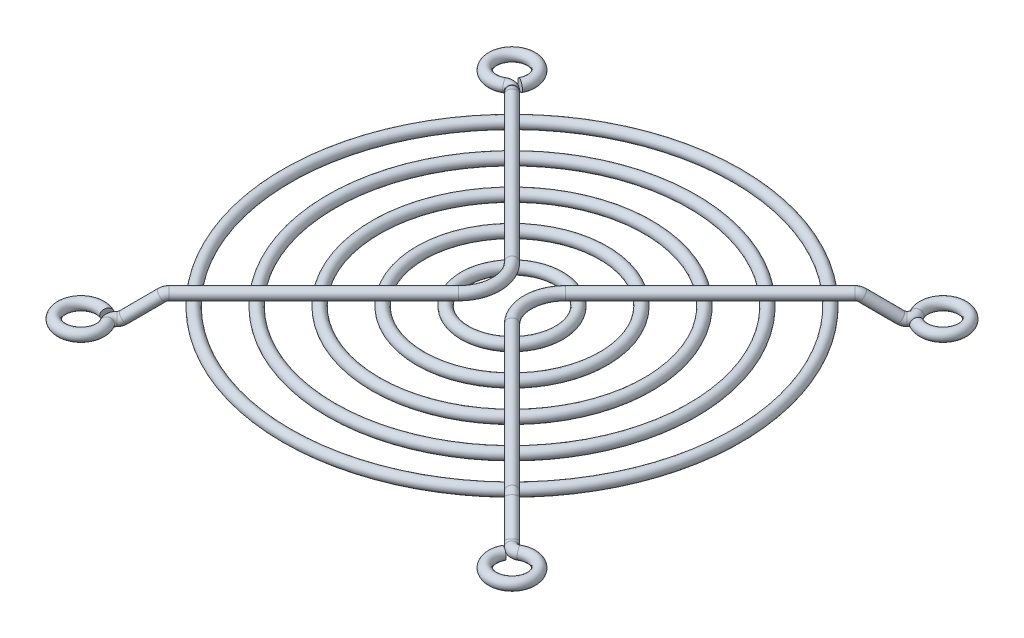
ISO-10303-21;
HEADER;
FILE_DESCRIPTION(('STEP AP214'),'2;1');
FILE_NAME('part.step','',(''),(''),'','','');
FILE_SCHEMA(('AUTOMOTIVE_DESIGN { 1 0 10303 214 1 1 1 1 }'));
ENDSEC;
DATA;
#1=APPLICATION_CONTEXT('core data for automotive mechanical design processes');
#2=APPLICATION_PROTOCOL_DEFINITION('international standard','automotive_design',2000,#1);
#3=PRODUCT_CONTEXT('',#1,'mechanical');
#4=PRODUCT('Part','Part','',(#3));
#5=PRODUCT_RELATED_PRODUCT_CATEGORY('part','',(#4));
#6=PRODUCT_DEFINITION_FORMATION('','',#4);
#7=PRODUCT_DEFINITION_CONTEXT('part definition',#1,'design');
#8=PRODUCT_DEFINITION('design','',#6,#7);
#9=PRODUCT_DEFINITION_SHAPE('','',#8);
#10=(LENGTH_UNIT() NAMED_UNIT(*) SI_UNIT(.MILLI.,.METRE.));
#11=(NAMED_UNIT(*) PLANE_ANGLE_UNIT() SI_UNIT($,.RADIAN.));
#12=(NAMED_UNIT(*) SI_UNIT($,.STERADIAN.) SOLID_ANGLE_UNIT());
#13=UNCERTAINTY_MEASURE_WITH_UNIT(LENGTH_MEASURE(1.E-05),#10,'distance_accuracy_value','');
#14=(GEOMETRIC_REPRESENTATION_CONTEXT(3) GLOBAL_UNCERTAINTY_ASSIGNED_CONTEXT((#13)) GLOBAL_UNIT_ASSIGNED_CONTEXT((#10,
#11,#12)) REPRESENTATION_CONTEXT('',''));
#15=CARTESIAN_POINT('',(0.,0.,0.));
#16=DIRECTION('',(0.,0.,1.));
#17=DIRECTION('',(1.,0.,0.));
#18=AXIS2_PLACEMENT_3D('',#15,#16,#17);
#19=CARTESIAN_POINT('',(4.43847763108504,4.6,4.43847763108509));
#20=DIRECTION('',(0.707106781186544,0.,0.707106781186552));
#21=DIRECTION('',(0.707106781186552,0.,-0.707106781186544));
#22=AXIS2_PLACEMENT_3D('',#19,#20,#21);
#23=CYLINDRICAL_SURFACE('',#22,0.9);
#24=CARTESIAN_POINT('',(4.43847763108504,4.6,4.43847763108509));
#25=DIRECTION('',(-0.707106781186544,0.,-0.707106781186551));
#26=DIRECTION('',(-0.707106781186551,0.,0.707106781186544));
#27=AXIS2_PLACEMENT_3D('',#24,#25,#26);
#28=CIRCLE('',#27,0.9);
#29=CARTESIAN_POINT('',(3.80208152801715,4.6,5.07487373415297));
#30=VERTEX_POINT('',#29);
#31=EDGE_CURVE('E11',#30,#30,#28,.T.);
#32=ORIENTED_EDGE('',*,*,#31,.F.);
#33=EDGE_LOOP('',(#32));
#34=FACE_BOUND('',#33,.T.);
#35=CARTESIAN_POINT('',(28.4610479427584,4.6,28.4610479427587));
#36=DIRECTION('',(0.707106781186543,0.,0.707106781186552));
#37=DIRECTION('',(0.707106781186552,0.,-0.707106781186543));
#38=AXIS2_PLACEMENT_3D('',#35,#36,#37);
#39=CIRCLE('',#38,0.9);
#40=CARTESIAN_POINT('',(28.4610479427584,5.5,28.4610479427587));
#41=VERTEX_POINT('',#40);
#42=EDGE_CURVE('E60',#41,#41,#39,.T.);
#43=ORIENTED_EDGE('',*,*,#42,.F.);
#44=EDGE_LOOP('',(#43));
#45=FACE_BOUND('',#44,.T.);
#46=ADVANCED_FACE('F41',(#34,#45),#23,.T.);
#47=CARTESIAN_POINT('',(32.7801515190163,2.31228886345619,32.7801515190167));
#48=DIRECTION('',(-0.707106781186546,0.,0.707106781186549));
#49=DIRECTION('',(0.707106781186549,0.,0.707106781186546));
#50=AXIS2_PLACEMENT_3D('',#47,#48,#49);
#51=TOROIDAL_SURFACE('',#50,1.41228886345618,0.9);
#52=CARTESIAN_POINT('',(32.2016837710717,1.161067788676,32.201683771072));
#53=DIRECTION('',(0.576394992331678,-0.579256096756797,0.576394992331687));
#54=DIRECTION('',(0.707106781186551,0.,-0.707106781186544));
#55=AXIS2_PLACEMENT_3D('',#52,#53,#54);
#56=CIRCLE('',#55,0.9);
#57=CARTESIAN_POINT('',(31.8330474484173,0.427436734780553,31.8330474484177));
#58=VERTEX_POINT('',#57);
#59=EDGE_CURVE('E51',#58,#58,#56,.T.);
#60=CARTESIAN_POINT('',(32.7801515190163,0.900000000000005,32.7801515190166));
#61=DIRECTION('',(0.707106781186543,0.,0.707106781186552));
#62=DIRECTION('',(0.707106781186552,0.,-0.707106781186543));
#63=AXIS2_PLACEMENT_3D('',#60,#61,#62);
#64=CIRCLE('',#63,0.9);
#65=CARTESIAN_POINT('',(32.7801515190163,0.,32.7801515190166));
#66=VERTEX_POINT('',#65);
#67=EDGE_CURVE('E47',#66,#66,#64,.T.);
#68=CARTESIAN_POINT('',(32.7801515190163,2.31228886345619,32.7801515190167));
#69=DIRECTION('',(-0.707106781186546,0.,0.707106781186549));
#70=DIRECTION('',(0.707106781186549,0.,0.707106781186546));
#71=AXIS2_PLACEMENT_3D('',#68,#69,#70);
#72=CIRCLE('',#71,2.31228886345618);
#73=EDGE_CURVE('',#58,#66,#72,.T.);
#74=ORIENTED_EDGE('',*,*,#59,.T.);
#75=ORIENTED_EDGE('',*,*,#67,.F.);
#76=ORIENTED_EDGE('',*,*,#73,.T.);
#77=ORIENTED_EDGE('',*,*,#73,.F.);
#78=EDGE_LOOP('',(#74,#76,#75,#77));
#79=FACE_BOUND('',#78,.T.);
#80=ADVANCED_FACE('F118',(#79),#51,.T.);
#81=CARTESIAN_POINT('',(29.039515690703,4.33893221132402,29.0395156907033));
#82=DIRECTION('',(0.576394992331679,-0.579256096756805,0.576394992331677));
#83=DIRECTION('',(-0.708855229154367,-0.705353999138383,0.));
#84=AXIS2_PLACEMENT_3D('',#81,#82,#83);
#85=CYLINDRICAL_SURFACE('',#84,0.9);
#86=CARTESIAN_POINT('',(29.039515690703,4.33893221132402,29.0395156907033));
#87=DIRECTION('',(0.576394992331678,-0.579256096756797,0.576394992331687));
#88=DIRECTION('',(0.707106781186551,0.,-0.707106781186544));
#89=AXIS2_PLACEMENT_3D('',#86,#87,#88);
#90=CIRCLE('',#89,0.9);
#91=CARTESIAN_POINT('',(29.4081520133573,5.07256326521949,29.4081520133577));
#92=VERTEX_POINT('',#91);
#93=EDGE_CURVE('E55',#92,#92,#90,.T.);
#94=ORIENTED_EDGE('',*,*,#93,.T.);
#95=EDGE_LOOP('',(#94));
#96=FACE_BOUND('',#95,.T.);
#97=ORIENTED_EDGE('',*,*,#59,.F.);
#98=EDGE_LOOP('',(#97));
#99=FACE_BOUND('',#98,.T.);
#100=ADVANCED_FACE('F123',(#96,#99),#85,.T.);
#101=CARTESIAN_POINT('',(28.4610479427584,3.18771113654381,28.4610479427587));
#102=DIRECTION('',(-0.707106781186546,0.,0.707106781186549));
#103=DIRECTION('',(0.707106781186549,0.,0.707106781186546));
#104=AXIS2_PLACEMENT_3D('',#101,#102,#103);
#105=TOROIDAL_SURFACE('',#104,1.41228886345619,0.9);
#106=CARTESIAN_POINT('',(28.4610479427584,3.18771113654381,28.4610479427587));
#107=DIRECTION('',(-0.707106781186546,0.,0.707106781186549));
#108=DIRECTION('',(0.707106781186549,0.,0.707106781186546));
#109=AXIS2_PLACEMENT_3D('',#106,#107,#108);
#110=CIRCLE('',#109,2.31228886345619);
#111=EDGE_CURVE('',#92,#41,#110,.T.);
#112=ORIENTED_EDGE('',*,*,#93,.F.);
#113=ORIENTED_EDGE('',*,*,#42,.T.);
#114=ORIENTED_EDGE('',*,*,#111,.T.);
#115=ORIENTED_EDGE('',*,*,#111,.F.);
#116=EDGE_LOOP('',(#112,#114,#113,#115));
#117=FACE_BOUND('',#116,.T.);
#118=ADVANCED_FACE('F128',(#117),#105,.T.);
#119=CARTESIAN_POINT('',(35.7499999999998,0.900000000000005,35.7500000000002));
#120=DIRECTION('',(0.,-1.,0.));
#121=DIRECTION('',(0.,0.,1.));
#122=AXIS2_PLACEMENT_3D('',#119,#120,#121);
#123=TOROIDAL_SURFACE('',#122,3.19999999999997,0.899999999999988);
#124=CARTESIAN_POINT('',(34.1690025713039,0.900000000000005,32.9678340936501));
#125=DIRECTION('',(0.869426845734396,0.,-0.494061696467495));
#126=DIRECTION('',(-0.494061696467495,0.,-0.869426845734396));
#127=AXIS2_PLACEMENT_3D('',#124,#125,#126);
#128=CIRCLE('',#127,0.899999999999988);
#129=CARTESIAN_POINT('',(33.7243470444832,0.900000000000005,32.1853499324892));
#130=VERTEX_POINT('',#129);
#131=EDGE_CURVE('E66',#130,#130,#128,.T.);
#132=CARTESIAN_POINT('',(32.9158008378051,0.900000000000005,34.2642964262632));
#133=DIRECTION('',(0.464282366792794,0.,-0.885687238185852));
#134=DIRECTION('',(-0.885687238185852,0.,-0.464282366792794));
#135=AXIS2_PLACEMENT_3D('',#132,#133,#134);
#136=CIRCLE('',#135,0.899999999999988);
#137=CARTESIAN_POINT('',(32.1186823234379,0.900000000000005,33.8464422961497));
#138=VERTEX_POINT('',#137);
#139=EDGE_CURVE('E63',#138,#138,#136,.T.);
#140=CARTESIAN_POINT('',(35.7499999999998,0.900000000000005,35.7500000000002));
#141=DIRECTION('',(0.,-1.,0.));
#142=DIRECTION('',(0.,0.,1.));
#143=AXIS2_PLACEMENT_3D('',#140,#141,#142);
#144=CIRCLE('',#143,4.09999999999996);
#145=EDGE_CURVE('',#130,#138,#144,.T.);
#146=ORIENTED_EDGE('',*,*,#131,.T.);
#147=ORIENTED_EDGE('',*,*,#139,.F.);
#148=ORIENTED_EDGE('',*,*,#145,.T.);
#149=ORIENTED_EDGE('',*,*,#145,.F.);
#150=EDGE_LOOP('',(#146,#148,#147,#149));
#151=FACE_BOUND('',#150,.T.);
#152=ADVANCED_FACE('F130',(#151),#123,.T.);
#153=CARTESIAN_POINT('',(33.5977437347633,0.900000000000005,31.9625593032697));
#154=DIRECTION('',(0.,-1.,0.));
#155=DIRECTION('',(0.,0.,1.));
#156=AXIS2_PLACEMENT_3D('',#153,#154,#155);
#157=TOROIDAL_SURFACE('',#156,1.15625000000005,0.899999999999988);
#158=ORIENTED_EDGE('',*,*,#131,.F.);
#159=EDGE_LOOP('',(#158));
#160=FACE_BOUND('',#159,.T.);
#161=ORIENTED_EDGE('',*,*,#67,.T.);
#162=EDGE_LOOP('',(#161));
#163=FACE_BOUND('',#162,.T.);
#164=ADVANCED_FACE('F137',(#160,#163),#157,.T.);
#165=CARTESIAN_POINT('',(32.9158008378051,0.900000000000005,34.2642964262632));
#166=DIRECTION('',(0.464282366792794,0.,-0.885687238185852));
#167=DIRECTION('',(-0.885687238185852,0.,-0.464282366792794));
#168=AXIS2_PLACEMENT_3D('',#165,#166,#167);
#169=PLANE('',#168);
#170=ORIENTED_EDGE('',*,*,#139,.T.);
#171=EDGE_LOOP('',(#170));
#172=FACE_BOUND('',#171,.T.);
#173=ADVANCED_FACE('F140',(#172),#169,.T.);
#174=CARTESIAN_POINT('',(8.87695526217018,4.6,0.));
#175=DIRECTION('',(0.,-1.,0.));
#176=DIRECTION('',(0.,0.,-1.));
#177=AXIS2_PLACEMENT_3D('',#174,#175,#176);
#178=TOROIDAL_SURFACE('',#177,6.27695526217018,0.899999999999991);
#179=CARTESIAN_POINT('',(4.43847763108504,4.6,-4.43847763108508));
#180=DIRECTION('',(-0.707106781186544,0.,0.707106781186551));
#181=DIRECTION('',(0.707106781186551,0.,0.707106781186544));
#182=AXIS2_PLACEMENT_3D('',#179,#180,#181);
#183=CIRCLE('',#182,0.9);
#184=CARTESIAN_POINT('',(3.80208152801715,4.6,-5.07487373415297));
#185=VERTEX_POINT('',#184);
#186=EDGE_CURVE('E69',#185,#185,#183,.T.);
#187=CARTESIAN_POINT('',(8.87695526217018,4.6,0.));
#188=DIRECTION('',(0.,-1.,0.));
#189=DIRECTION('',(0.,0.,-1.));
#190=AXIS2_PLACEMENT_3D('',#187,#188,#189);
#191=CIRCLE('',#190,7.17695526217017);
#192=EDGE_CURVE('',#30,#185,#191,.T.);
#193=ORIENTED_EDGE('',*,*,#31,.T.);
#194=ORIENTED_EDGE('',*,*,#186,.T.);
#195=ORIENTED_EDGE('',*,*,#192,.T.);
#196=ORIENTED_EDGE('',*,*,#192,.F.);
#197=EDGE_LOOP('',(#193,#195,#194,#196));
#198=FACE_BOUND('',#197,.T.);
#199=ADVANCED_FACE('F114',(#198),#178,.T.);
#200=CARTESIAN_POINT('',(4.43847763108504,4.6,-4.43847763108508));
#201=DIRECTION('',(0.707106781186544,0.,-0.707106781186551));
#202=DIRECTION('',(-0.707106781186551,0.,-0.707106781186544));
#203=AXIS2_PLACEMENT_3D('',#200,#201,#202);
#204=CYLINDRICAL_SURFACE('',#203,0.9);
#205=ORIENTED_EDGE('',*,*,#186,.F.);
#206=EDGE_LOOP('',(#205));
#207=FACE_BOUND('',#206,.T.);
#208=CARTESIAN_POINT('',(28.4610479427584,4.6,-28.4610479427587));
#209=DIRECTION('',(0.707106781186544,0.,-0.707106781186551));
#210=DIRECTION('',(-0.707106781186551,0.,-0.707106781186544));
#211=AXIS2_PLACEMENT_3D('',#208,#209,#210);
#212=CIRCLE('',#211,0.9);
#213=CARTESIAN_POINT('',(28.4610479427584,5.5,-28.4610479427587));
#214=VERTEX_POINT('',#213);
#215=EDGE_CURVE('E81',#214,#214,#212,.T.);
#216=ORIENTED_EDGE('',*,*,#215,.F.);
#217=EDGE_LOOP('',(#216));
#218=FACE_BOUND('',#217,.T.);
#219=ADVANCED_FACE('F104',(#207,#218),#204,.T.);
#220=CARTESIAN_POINT('',(32.7801515190163,2.31228886345619,-32.7801515190167));
#221=DIRECTION('',(0.707106781186556,0.,0.707106781186539));
#222=DIRECTION('',(0.707106781186539,0.,-0.707106781186556));
#223=AXIS2_PLACEMENT_3D('',#220,#221,#222);
#224=TOROIDAL_SURFACE('',#223,1.41228886345618,0.9);
#225=CARTESIAN_POINT('',(32.2016837710717,1.161067788676,-32.201683771072));
#226=DIRECTION('',(0.576394992331681,-0.579256096756797,-0.576394992331684));
#227=DIRECTION('',(-0.707106781186552,0.,-0.707106781186543));
#228=AXIS2_PLACEMENT_3D('',#225,#226,#227);
#229=CIRCLE('',#228,0.9);
#230=CARTESIAN_POINT('',(31.8330474484173,0.427436734780553,-31.8330474484177));
#231=VERTEX_POINT('',#230);
#232=EDGE_CURVE('E75',#231,#231,#229,.T.);
#233=CARTESIAN_POINT('',(32.7801515190163,0.900000000000005,-32.7801515190167));
#234=DIRECTION('',(0.707106781186544,0.,-0.707106781186551));
#235=DIRECTION('',(-0.707106781186551,0.,-0.707106781186544));
#236=AXIS2_PLACEMENT_3D('',#233,#234,#235);
#237=CIRCLE('',#236,0.9);
#238=CARTESIAN_POINT('',(32.7801515190163,0.,-32.7801515190167));
#239=VERTEX_POINT('',#238);
#240=EDGE_CURVE('E72',#239,#239,#237,.T.);
#241=CARTESIAN_POINT('',(32.7801515190163,2.31228886345619,-32.7801515190167));
#242=DIRECTION('',(0.707106781186556,0.,0.707106781186539));
#243=DIRECTION('',(0.707106781186539,0.,-0.707106781186556));
#244=AXIS2_PLACEMENT_3D('',#241,#242,#243);
#245=CIRCLE('',#244,2.31228886345618);
#246=EDGE_CURVE('',#231,#239,#245,.T.);
#247=ORIENTED_EDGE('',*,*,#232,.T.);
#248=ORIENTED_EDGE('',*,*,#240,.F.);
#249=ORIENTED_EDGE('',*,*,#246,.T.);
#250=ORIENTED_EDGE('',*,*,#246,.F.);
#251=EDGE_LOOP('',(#247,#249,#248,#250));
#252=FACE_BOUND('',#251,.T.);
#253=ADVANCED_FACE('F101',(#252),#224,.T.);
#254=CARTESIAN_POINT('',(29.039515690703,4.33893221132402,-29.0395156907033));
#255=DIRECTION('',(0.576394992331671,-0.579256096756805,-0.576394992331685));
#256=DIRECTION('',(0.,-0.705353999138383,0.708855229154367));
#257=AXIS2_PLACEMENT_3D('',#254,#255,#256);
#258=CYLINDRICAL_SURFACE('',#257,0.9);
#259=CARTESIAN_POINT('',(29.039515690703,4.33893221132402,-29.0395156907033));
#260=DIRECTION('',(0.576394992331681,-0.579256096756797,-0.576394992331684));
#261=DIRECTION('',(-0.707106781186552,0.,-0.707106781186543));
#262=AXIS2_PLACEMENT_3D('',#259,#260,#261);
#263=CIRCLE('',#262,0.9);
#264=CARTESIAN_POINT('',(29.4081520133574,5.07256326521949,-29.4081520133577));
#265=VERTEX_POINT('',#264);
#266=EDGE_CURVE('E78',#265,#265,#263,.T.);
#267=ORIENTED_EDGE('',*,*,#266,.T.);
#268=EDGE_LOOP('',(#267));
#269=FACE_BOUND('',#268,.T.);
#270=ORIENTED_EDGE('',*,*,#232,.F.);
#271=EDGE_LOOP('',(#270));
#272=FACE_BOUND('',#271,.T.);
#273=ADVANCED_FACE('F103',(#269,#272),#258,.T.);
#274=CARTESIAN_POINT('',(28.4610479427584,3.18771113654381,-28.4610479427587));
#275=DIRECTION('',(0.707106781186556,0.,0.707106781186539));
#276=DIRECTION('',(0.707106781186539,0.,-0.707106781186556));
#277=AXIS2_PLACEMENT_3D('',#274,#275,#276);
#278=TOROIDAL_SURFACE('',#277,1.41228886345619,0.9);
#279=CARTESIAN_POINT('',(28.4610479427584,3.18771113654381,-28.4610479427587));
#280=DIRECTION('',(0.707106781186556,0.,0.707106781186539));
#281=DIRECTION('',(0.707106781186539,0.,-0.707106781186556));
#282=AXIS2_PLACEMENT_3D('',#279,#280,#281);
#283=CIRCLE('',#282,2.31228886345619);
#284=EDGE_CURVE('',#265,#214,#283,.T.);
#285=ORIENTED_EDGE('',*,*,#266,.F.);
#286=ORIENTED_EDGE('',*,*,#215,.T.);
#287=ORIENTED_EDGE('',*,*,#284,.T.);
#288=ORIENTED_EDGE('',*,*,#284,.F.);
#289=EDGE_LOOP('',(#285,#287,#286,#288));
#290=FACE_BOUND('',#289,.T.);
#291=ADVANCED_FACE('F111',(#290),#278,.T.);
#292=CARTESIAN_POINT('',(35.7499999999998,0.900000000000005,-35.7500000000002));
#293=DIRECTION('',(0.,-1.,0.));
#294=DIRECTION('',(1.,0.,0.));
#295=AXIS2_PLACEMENT_3D('',#292,#293,#294);
#296=TOROIDAL_SURFACE('',#295,3.19999999999997,0.899999999999988);
#297=CARTESIAN_POINT('',(32.9678340936498,0.900000000000005,-34.1690025713042));
#298=DIRECTION('',(-0.494061696467505,0.,-0.86942684573439));
#299=DIRECTION('',(-0.86942684573439,0.,0.494061696467505));
#300=AXIS2_PLACEMENT_3D('',#297,#298,#299);
#301=CIRCLE('',#300,0.899999999999988);
#302=CARTESIAN_POINT('',(32.1853499324888,0.900000000000005,-33.7243470444835));
#303=VERTEX_POINT('',#302);
#304=EDGE_CURVE('E87',#303,#303,#301,.T.);
#305=CARTESIAN_POINT('',(34.2642964262628,0.900000000000005,-32.9158008378055));
#306=DIRECTION('',(-0.885687238185856,0.,-0.464282366792785));
#307=DIRECTION('',(-0.464282366792785,0.,0.885687238185856));
#308=AXIS2_PLACEMENT_3D('',#305,#306,#307);
#309=CIRCLE('',#308,0.899999999999988);
#310=CARTESIAN_POINT('',(33.8464422961493,0.900000000000005,-32.1186823234383));
#311=VERTEX_POINT('',#310);
#312=EDGE_CURVE('E84',#311,#311,#309,.T.);
#313=CARTESIAN_POINT('',(35.7499999999998,0.900000000000005,-35.7500000000002));
#314=DIRECTION('',(0.,-1.,0.));
#315=DIRECTION('',(1.,0.,0.));
#316=AXIS2_PLACEMENT_3D('',#313,#314,#315);
#317=CIRCLE('',#316,4.09999999999996);
#318=EDGE_CURVE('',#303,#311,#317,.T.);
#319=ORIENTED_EDGE('',*,*,#304,.T.);
#320=ORIENTED_EDGE('',*,*,#312,.F.);
#321=ORIENTED_EDGE('',*,*,#318,.T.);
#322=ORIENTED_EDGE('',*,*,#318,.F.);
#323=EDGE_LOOP('',(#319,#321,#320,#322));
#324=FACE_BOUND('',#323,.T.);
#325=ADVANCED_FACE('F91',(#324),#296,.T.);
#326=CARTESIAN_POINT('',(31.9625593032693,0.900000000000005,-33.5977437347637));
#327=DIRECTION('',(0.,-1.,0.));
#328=DIRECTION('',(1.,0.,0.));
#329=AXIS2_PLACEMENT_3D('',#326,#327,#328);
#330=TOROIDAL_SURFACE('',#329,1.15625000000005,0.899999999999988);
#331=ORIENTED_EDGE('',*,*,#304,.F.);
#332=EDGE_LOOP('',(#331));
#333=FACE_BOUND('',#332,.T.);
#334=ORIENTED_EDGE('',*,*,#240,.T.);
#335=EDGE_LOOP('',(#334));
#336=FACE_BOUND('',#335,.T.);
#337=ADVANCED_FACE('F94',(#333,#336),#330,.T.);
#338=CARTESIAN_POINT('',(34.2642964262628,0.900000000000005,-32.9158008378055));
#339=DIRECTION('',(-0.885687238185856,0.,-0.464282366792785));
#340=DIRECTION('',(-0.464282366792785,0.,0.885687238185856));
#341=AXIS2_PLACEMENT_3D('',#338,#339,#340);
#342=PLANE('',#341);
#343=ORIENTED_EDGE('',*,*,#312,.T.);
#344=EDGE_LOOP('',(#343));
#345=FACE_BOUND('',#344,.T.);
#346=ADVANCED_FACE('F97',(#345),#342,.T.);
#347=CLOSED_SHELL('',(#46,#80,#100,#118,#152,#164,#173,#199,#219,#253,#273,#291,#325,#337,#346));
#348=MANIFOLD_SOLID_BREP('B2',#347);
#349=CARTESIAN_POINT('',(-4.43847763108508,4.6,4.43847763108505));
#350=DIRECTION('',(-0.707106781186549,0.,0.707106781186546));
#351=DIRECTION('',(0.707106781186546,0.,0.707106781186549));
#352=AXIS2_PLACEMENT_3D('',#349,#350,#351);
#353=CYLINDRICAL_SURFACE('',#352,0.9);
#354=CARTESIAN_POINT('',(-4.43847763108508,4.6,4.43847763108505));
#355=DIRECTION('',(0.707106781186549,0.,-0.707106781186546));
#356=DIRECTION('',(-0.707106781186546,0.,-0.707106781186549));
#357=AXIS2_PLACEMENT_3D('',#354,#355,#356);
#358=CIRCLE('',#357,0.9);
#359=CARTESIAN_POINT('',(-3.80208152801719,4.6,5.07487373415294));
#360=VERTEX_POINT('',#359);
#361=EDGE_CURVE('E40',#360,#360,#358,.T.);
#362=ORIENTED_EDGE('',*,*,#361,.F.);
#363=EDGE_LOOP('',(#362));
#364=FACE_BOUND('',#363,.T.);
#365=CARTESIAN_POINT('',(-28.4610479427586,4.6,28.4610479427585));
#366=DIRECTION('',(-0.707106781186549,0.,0.707106781186546));
#367=DIRECTION('',(0.707106781186546,0.,0.707106781186549));
#368=AXIS2_PLACEMENT_3D('',#365,#366,#367);
#369=CIRCLE('',#368,0.9);
#370=CARTESIAN_POINT('',(-28.4610479427586,5.5,28.4610479427585));
#371=VERTEX_POINT('',#370);
#372=EDGE_CURVE('E286',#371,#371,#369,.T.);
#373=ORIENTED_EDGE('',*,*,#372,.F.);
#374=EDGE_LOOP('',(#373));
#375=FACE_BOUND('',#374,.T.);
#376=ADVANCED_FACE('F267',(#364,#375),#353,.T.);
#377=CARTESIAN_POINT('',(-32.7801515190165,2.31228886345619,32.7801515190164));
#378=DIRECTION('',(-0.707106781186551,0.,-0.707106781186544));
#379=DIRECTION('',(-0.707106781186544,0.,0.707106781186551));
#380=AXIS2_PLACEMENT_3D('',#377,#378,#379);
#381=TOROIDAL_SURFACE('',#380,1.41228886345618,0.9);
#382=CARTESIAN_POINT('',(-32.2016837710719,1.161067788676,32.2016837710718));
#383=DIRECTION('',(-0.576394992331685,-0.579256096756797,0.57639499233168));
#384=DIRECTION('',(0.707106781186547,0.,0.707106781186548));
#385=AXIS2_PLACEMENT_3D('',#382,#383,#384);
#386=CIRCLE('',#385,0.9);
#387=CARTESIAN_POINT('',(-31.8330474484175,0.427436734780553,31.8330474484174));
#388=VERTEX_POINT('',#387);
#389=EDGE_CURVE('E277',#388,#388,#386,.T.);
#390=CARTESIAN_POINT('',(-32.7801515190165,0.900000000000005,32.7801515190164));
#391=DIRECTION('',(-0.707106781186549,0.,0.707106781186546));
#392=DIRECTION('',(0.707106781186546,0.,0.707106781186549));
#393=AXIS2_PLACEMENT_3D('',#390,#391,#392);
#394=CIRCLE('',#393,0.9);
#395=CARTESIAN_POINT('',(-32.7801515190165,0.,32.7801515190164));
#396=VERTEX_POINT('',#395);
#397=EDGE_CURVE('E273',#396,#396,#394,.T.);
#398=CARTESIAN_POINT('',(-32.7801515190165,2.31228886345619,32.7801515190164));
#399=DIRECTION('',(-0.707106781186551,0.,-0.707106781186544));
#400=DIRECTION('',(-0.707106781186544,0.,0.707106781186551));
#401=AXIS2_PLACEMENT_3D('',#398,#399,#400);
#402=CIRCLE('',#401,2.31228886345618);
#403=EDGE_CURVE('',#388,#396,#402,.T.);
#404=ORIENTED_EDGE('',*,*,#389,.T.);
#405=ORIENTED_EDGE('',*,*,#397,.F.);
#406=ORIENTED_EDGE('',*,*,#403,.T.);
#407=ORIENTED_EDGE('',*,*,#403,.F.);
#408=EDGE_LOOP('',(#404,#406,#405,#407));
#409=FACE_BOUND('',#408,.T.);
#410=ADVANCED_FACE('F344',(#409),#381,.T.);
#411=CARTESIAN_POINT('',(-29.0395156907032,4.33893221132402,29.0395156907031));
#412=DIRECTION('',(-0.576394992331675,-0.579256096756805,0.576394992331681));
#413=DIRECTION('',(0.,-0.705353999138383,-0.708855229154367));
#414=AXIS2_PLACEMENT_3D('',#411,#412,#413);
#415=CYLINDRICAL_SURFACE('',#414,0.9);
#416=CARTESIAN_POINT('',(-29.0395156907032,4.33893221132402,29.0395156907031));
#417=DIRECTION('',(-0.576394992331685,-0.579256096756797,0.57639499233168));
#418=DIRECTION('',(0.707106781186547,0.,0.707106781186548));
#419=AXIS2_PLACEMENT_3D('',#416,#417,#418);
#420=CIRCLE('',#419,0.9);
#421=CARTESIAN_POINT('',(-29.4081520133576,5.07256326521949,29.4081520133574));
#422=VERTEX_POINT('',#421);
#423=EDGE_CURVE('E281',#422,#422,#420,.T.);
#424=ORIENTED_EDGE('',*,*,#423,.T.);
#425=EDGE_LOOP('',(#424));
#426=FACE_BOUND('',#425,.T.);
#427=ORIENTED_EDGE('',*,*,#389,.F.);
#428=EDGE_LOOP('',(#427));
#429=FACE_BOUND('',#428,.T.);
#430=ADVANCED_FACE('F349',(#426,#429),#415,.T.);
#431=CARTESIAN_POINT('',(-28.4610479427586,3.18771113654381,28.4610479427585));
#432=DIRECTION('',(-0.707106781186551,0.,-0.707106781186544));
#433=DIRECTION('',(-0.707106781186544,0.,0.707106781186551));
#434=AXIS2_PLACEMENT_3D('',#431,#432,#433);
#435=TOROIDAL_SURFACE('',#434,1.41228886345619,0.9);
#436=CARTESIAN_POINT('',(-28.4610479427586,3.18771113654381,28.4610479427585));
#437=DIRECTION('',(-0.707106781186551,0.,-0.707106781186544));
#438=DIRECTION('',(-0.707106781186544,0.,0.707106781186551));
#439=AXIS2_PLACEMENT_3D('',#436,#437,#438);
#440=CIRCLE('',#439,2.31228886345619);
#441=EDGE_CURVE('',#422,#371,#440,.T.);
#442=ORIENTED_EDGE('',*,*,#423,.F.);
#443=ORIENTED_EDGE('',*,*,#372,.T.);
#444=ORIENTED_EDGE('',*,*,#441,.T.);
#445=ORIENTED_EDGE('',*,*,#441,.F.);
#446=EDGE_LOOP('',(#442,#444,#443,#445));
#447=FACE_BOUND('',#446,.T.);
#448=ADVANCED_FACE('F354',(#447),#435,.T.);
#449=CARTESIAN_POINT('',(-35.7500000000001,0.900000000000005,35.7499999999999));
#450=DIRECTION('',(0.,-1.,0.));
#451=DIRECTION('',(-1.,0.,0.));
#452=AXIS2_PLACEMENT_3D('',#449,#450,#451);
#453=TOROIDAL_SURFACE('',#452,3.19999999999997,0.899999999999988);
#454=CARTESIAN_POINT('',(-32.96783409365,0.900000000000005,34.169002571304));
#455=DIRECTION('',(0.494061696467498,0.,0.869426845734394));
#456=DIRECTION('',(0.869426845734394,0.,-0.494061696467498));
#457=AXIS2_PLACEMENT_3D('',#454,#455,#456);
#458=CIRCLE('',#457,0.899999999999988);
#459=CARTESIAN_POINT('',(-32.185349932489,0.900000000000005,33.7243470444833));
#460=VERTEX_POINT('',#459);
#461=EDGE_CURVE('E292',#460,#460,#458,.T.);
#462=CARTESIAN_POINT('',(-34.2642964262631,0.900000000000005,32.9158008378053));
#463=DIRECTION('',(0.885687238185853,0.,0.464282366792791));
#464=DIRECTION('',(0.464282366792791,0.,-0.885687238185853));
#465=AXIS2_PLACEMENT_3D('',#462,#463,#464);
#466=CIRCLE('',#465,0.899999999999988);
#467=CARTESIAN_POINT('',(-33.8464422961495,0.900000000000005,32.118682323438));
#468=VERTEX_POINT('',#467);
#469=EDGE_CURVE('E289',#468,#468,#466,.T.);
#470=CARTESIAN_POINT('',(-35.7500000000001,0.900000000000005,35.7499999999999));
#471=DIRECTION('',(0.,-1.,0.));
#472=DIRECTION('',(-1.,0.,0.));
#473=AXIS2_PLACEMENT_3D('',#470,#471,#472);
#474=CIRCLE('',#473,4.09999999999996);
#475=EDGE_CURVE('',#460,#468,#474,.T.);
#476=ORIENTED_EDGE('',*,*,#461,.T.);
#477=ORIENTED_EDGE('',*,*,#469,.F.);
#478=ORIENTED_EDGE('',*,*,#475,.T.);
#479=ORIENTED_EDGE('',*,*,#475,.F.);
#480=EDGE_LOOP('',(#476,#478,#477,#479));
#481=FACE_BOUND('',#480,.T.);
#482=ADVANCED_FACE('F356',(#481),#453,.T.);
#483=CARTESIAN_POINT('',(-31.9625593032696,0.900000000000005,33.5977437347634));
#484=DIRECTION('',(0.,-1.,0.));
#485=DIRECTION('',(-1.,0.,0.));
#486=AXIS2_PLACEMENT_3D('',#483,#484,#485);
#487=TOROIDAL_SURFACE('',#486,1.15625000000005,0.899999999999988);
#488=ORIENTED_EDGE('',*,*,#461,.F.);
#489=EDGE_LOOP('',(#488));
#490=FACE_BOUND('',#489,.T.);
#491=ORIENTED_EDGE('',*,*,#397,.T.);
#492=EDGE_LOOP('',(#491));
#493=FACE_BOUND('',#492,.T.);
#494=ADVANCED_FACE('F363',(#490,#493),#487,.T.);
#495=CARTESIAN_POINT('',(-34.2642964262631,0.900000000000005,32.9158008378053));
#496=DIRECTION('',(0.885687238185853,0.,0.464282366792791));
#497=DIRECTION('',(0.464282366792791,0.,-0.885687238185853));
#498=AXIS2_PLACEMENT_3D('',#495,#496,#497);
#499=PLANE('',#498);
#500=ORIENTED_EDGE('',*,*,#469,.T.);
#501=EDGE_LOOP('',(#500));
#502=FACE_BOUND('',#501,.T.);
#503=ADVANCED_FACE('F366',(#502),#499,.T.);
#504=CARTESIAN_POINT('',(-8.87695526217014,4.6,0.));
#505=DIRECTION('',(0.,1.,0.));
#506=DIRECTION('',(0.,0.,1.));
#507=AXIS2_PLACEMENT_3D('',#504,#505,#506);
#508=TOROIDAL_SURFACE('',#507,6.27695526217012,0.89999999999999);
#509=CARTESIAN_POINT('',(-4.43847763108504,4.6,-4.43847763108509));
#510=DIRECTION('',(0.707106781186544,0.,0.707106781186551));
#511=DIRECTION('',(0.707106781186551,0.,-0.707106781186544));
#512=AXIS2_PLACEMENT_3D('',#509,#510,#511);
#513=CIRCLE('',#512,0.9);
#514=CARTESIAN_POINT('',(-3.80208152801715,4.6,-5.07487373415297));
#515=VERTEX_POINT('',#514);
#516=EDGE_CURVE('E295',#515,#515,#513,.T.);
#517=CARTESIAN_POINT('',(-8.87695526217014,4.6,0.));
#518=DIRECTION('',(0.,1.,0.));
#519=DIRECTION('',(0.,0.,1.));
#520=AXIS2_PLACEMENT_3D('',#517,#518,#519);
#521=CIRCLE('',#520,7.17695526217011);
#522=EDGE_CURVE('',#360,#515,#521,.T.);
#523=ORIENTED_EDGE('',*,*,#361,.T.);
#524=ORIENTED_EDGE('',*,*,#516,.T.);
#525=ORIENTED_EDGE('',*,*,#522,.T.);
#526=ORIENTED_EDGE('',*,*,#522,.F.);
#527=EDGE_LOOP('',(#523,#525,#524,#526));
#528=FACE_BOUND('',#527,.T.);
#529=ADVANCED_FACE('F340',(#528),#508,.T.);
#530=CARTESIAN_POINT('',(-4.43847763108504,4.6,-4.43847763108509));
#531=DIRECTION('',(-0.707106781186544,0.,-0.707106781186552));
#532=DIRECTION('',(-0.707106781186552,0.,0.707106781186544));
#533=AXIS2_PLACEMENT_3D('',#530,#531,#532);
#534=CYLINDRICAL_SURFACE('',#533,0.9);
#535=ORIENTED_EDGE('',*,*,#516,.F.);
#536=EDGE_LOOP('',(#535));
#537=FACE_BOUND('',#536,.T.);
#538=CARTESIAN_POINT('',(-28.4610479427584,4.6,-28.4610479427587));
#539=DIRECTION('',(-0.707106781186543,0.,-0.707106781186552));
#540=DIRECTION('',(-0.707106781186552,0.,0.707106781186543));
#541=AXIS2_PLACEMENT_3D('',#538,#539,#540);
#542=CIRCLE('',#541,0.9);
#543=CARTESIAN_POINT('',(-28.4610479427584,5.5,-28.4610479427587));
#544=VERTEX_POINT('',#543);
#545=EDGE_CURVE('E307',#544,#544,#542,.T.);
#546=ORIENTED_EDGE('',*,*,#545,.F.);
#547=EDGE_LOOP('',(#546));
#548=FACE_BOUND('',#547,.T.);
#549=ADVANCED_FACE('F330',(#537,#548),#534,.T.);
#550=CARTESIAN_POINT('',(-32.7801515190163,2.31228886345619,-32.7801515190167));
#551=DIRECTION('',(0.707106781186546,0.,-0.707106781186549));
#552=DIRECTION('',(-0.707106781186549,0.,-0.707106781186546));
#553=AXIS2_PLACEMENT_3D('',#550,#551,#552);
#554=TOROIDAL_SURFACE('',#553,1.41228886345618,0.9);
#555=CARTESIAN_POINT('',(-32.2016837710717,1.161067788676,-32.201683771072));
#556=DIRECTION('',(-0.576394992331678,-0.579256096756797,-0.576394992331687));
#557=DIRECTION('',(-0.707106781186551,0.,0.707106781186544));
#558=AXIS2_PLACEMENT_3D('',#555,#556,#557);
#559=CIRCLE('',#558,0.9);
#560=CARTESIAN_POINT('',(-31.8330474484173,0.427436734780553,-31.8330474484177));
#561=VERTEX_POINT('',#560);
#562=EDGE_CURVE('E301',#561,#561,#559,.T.);
#563=CARTESIAN_POINT('',(-32.7801515190163,0.900000000000005,-32.7801515190166));
#564=DIRECTION('',(-0.707106781186543,0.,-0.707106781186552));
#565=DIRECTION('',(-0.707106781186552,0.,0.707106781186543));
#566=AXIS2_PLACEMENT_3D('',#563,#564,#565);
#567=CIRCLE('',#566,0.9);
#568=CARTESIAN_POINT('',(-32.7801515190163,0.,-32.7801515190166));
#569=VERTEX_POINT('',#568);
#570=EDGE_CURVE('E298',#569,#569,#567,.T.);
#571=CARTESIAN_POINT('',(-32.7801515190163,2.31228886345619,-32.7801515190167));
#572=DIRECTION('',(0.707106781186546,0.,-0.707106781186549));
#573=DIRECTION('',(-0.707106781186549,0.,-0.707106781186546));
#574=AXIS2_PLACEMENT_3D('',#571,#572,#573);
#575=CIRCLE('',#574,2.31228886345618);
#576=EDGE_CURVE('',#561,#569,#575,.T.);
#577=ORIENTED_EDGE('',*,*,#562,.T.);
#578=ORIENTED_EDGE('',*,*,#570,.F.);
#579=ORIENTED_EDGE('',*,*,#576,.T.);
#580=ORIENTED_EDGE('',*,*,#576,.F.);
#581=EDGE_LOOP('',(#577,#579,#578,#580));
#582=FACE_BOUND('',#581,.T.);
#583=ADVANCED_FACE('F327',(#582),#554,.T.);
#584=CARTESIAN_POINT('',(-29.039515690703,4.33893221132402,-29.0395156907033));
#585=DIRECTION('',(-0.576394992331679,-0.579256096756805,-0.576394992331677));
#586=DIRECTION('',(0.708855229154367,-0.705353999138383,0.));
#587=AXIS2_PLACEMENT_3D('',#584,#585,#586);
#588=CYLINDRICAL_SURFACE('',#587,0.9);
#589=CARTESIAN_POINT('',(-29.039515690703,4.33893221132402,-29.0395156907033));
#590=DIRECTION('',(-0.576394992331678,-0.579256096756797,-0.576394992331687));
#591=DIRECTION('',(-0.707106781186551,0.,0.707106781186544));
#592=AXIS2_PLACEMENT_3D('',#589,#590,#591);
#593=CIRCLE('',#592,0.9);
#594=CARTESIAN_POINT('',(-29.4081520133573,5.07256326521949,-29.4081520133577));
#595=VERTEX_POINT('',#594);
#596=EDGE_CURVE('E304',#595,#595,#593,.T.);
#597=ORIENTED_EDGE('',*,*,#596,.T.);
#598=EDGE_LOOP('',(#597));
#599=FACE_BOUND('',#598,.T.);
#600=ORIENTED_EDGE('',*,*,#562,.F.);
#601=EDGE_LOOP('',(#600));
#602=FACE_BOUND('',#601,.T.);
#603=ADVANCED_FACE('F329',(#599,#602),#588,.T.);
#604=CARTESIAN_POINT('',(-28.4610479427584,3.18771113654381,-28.4610479427587));
#605=DIRECTION('',(0.707106781186546,0.,-0.707106781186549));
#606=DIRECTION('',(-0.707106781186549,0.,-0.707106781186546));
#607=AXIS2_PLACEMENT_3D('',#604,#605,#606);
#608=TOROIDAL_SURFACE('',#607,1.41228886345619,0.9);
#609=CARTESIAN_POINT('',(-28.4610479427584,3.18771113654381,-28.4610479427587));
#610=DIRECTION('',(0.707106781186546,0.,-0.707106781186549));
#611=DIRECTION('',(-0.707106781186549,0.,-0.707106781186546));
#612=AXIS2_PLACEMENT_3D('',#609,#610,#611);
#613=CIRCLE('',#612,2.31228886345619);
#614=EDGE_CURVE('',#595,#544,#613,.T.);
#615=ORIENTED_EDGE('',*,*,#596,.F.);
#616=ORIENTED_EDGE('',*,*,#545,.T.);
#617=ORIENTED_EDGE('',*,*,#614,.T.);
#618=ORIENTED_EDGE('',*,*,#614,.F.);
#619=EDGE_LOOP('',(#615,#617,#616,#618));
#620=FACE_BOUND('',#619,.T.);
#621=ADVANCED_FACE('F337',(#620),#608,.T.);
#622=CARTESIAN_POINT('',(-35.7499999999998,0.900000000000005,-35.7500000000002));
#623=DIRECTION('',(0.,-1.,0.));
#624=DIRECTION('',(0.,0.,-1.));
#625=AXIS2_PLACEMENT_3D('',#622,#623,#624);
#626=TOROIDAL_SURFACE('',#625,3.19999999999997,0.899999999999988);
#627=CARTESIAN_POINT('',(-34.1690025713039,0.900000000000005,-32.9678340936501));
#628=DIRECTION('',(-0.869426845734396,0.,0.494061696467495));
#629=DIRECTION('',(0.494061696467495,0.,0.869426845734396));
#630=AXIS2_PLACEMENT_3D('',#627,#628,#629);
#631=CIRCLE('',#630,0.899999999999988);
#632=CARTESIAN_POINT('',(-33.7243470444832,0.900000000000005,-32.1853499324892));
#633=VERTEX_POINT('',#632);
#634=EDGE_CURVE('E313',#633,#633,#631,.T.);
#635=CARTESIAN_POINT('',(-32.9158008378051,0.900000000000005,-34.2642964262632));
#636=DIRECTION('',(-0.464282366792794,0.,0.885687238185852));
#637=DIRECTION('',(0.885687238185852,0.,0.464282366792794));
#638=AXIS2_PLACEMENT_3D('',#635,#636,#637);
#639=CIRCLE('',#638,0.899999999999988);
#640=CARTESIAN_POINT('',(-32.1186823234379,0.900000000000005,-33.8464422961497));
#641=VERTEX_POINT('',#640);
#642=EDGE_CURVE('E310',#641,#641,#639,.T.);
#643=CARTESIAN_POINT('',(-35.7499999999998,0.900000000000005,-35.7500000000002));
#644=DIRECTION('',(0.,-1.,0.));
#645=DIRECTION('',(0.,0.,-1.));
#646=AXIS2_PLACEMENT_3D('',#643,#644,#645);
#647=CIRCLE('',#646,4.09999999999996);
#648=EDGE_CURVE('',#633,#641,#647,.T.);
#649=ORIENTED_EDGE('',*,*,#634,.T.);
#650=ORIENTED_EDGE('',*,*,#642,.F.);
#651=ORIENTED_EDGE('',*,*,#648,.T.);
#652=ORIENTED_EDGE('',*,*,#648,.F.);
#653=EDGE_LOOP('',(#649,#651,#650,#652));
#654=FACE_BOUND('',#653,.T.);
#655=ADVANCED_FACE('F317',(#654),#626,.T.);
#656=CARTESIAN_POINT('',(-33.5977437347633,0.900000000000005,-31.9625593032697));
#657=DIRECTION('',(0.,-1.,0.));
#658=DIRECTION('',(0.,0.,-1.));
#659=AXIS2_PLACEMENT_3D('',#656,#657,#658);
#660=TOROIDAL_SURFACE('',#659,1.15625000000005,0.899999999999988);
#661=ORIENTED_EDGE('',*,*,#634,.F.);
#662=EDGE_LOOP('',(#661));
#663=FACE_BOUND('',#662,.T.);
#664=ORIENTED_EDGE('',*,*,#570,.T.);
#665=EDGE_LOOP('',(#664));
#666=FACE_BOUND('',#665,.T.);
#667=ADVANCED_FACE('F320',(#663,#666),#660,.T.);
#668=CARTESIAN_POINT('',(-32.9158008378051,0.900000000000005,-34.2642964262632));
#669=DIRECTION('',(-0.464282366792794,0.,0.885687238185852));
#670=DIRECTION('',(0.885687238185852,0.,0.464282366792794));
#671=AXIS2_PLACEMENT_3D('',#668,#669,#670);
#672=PLANE('',#671);
#673=ORIENTED_EDGE('',*,*,#642,.T.);
#674=EDGE_LOOP('',(#673));
#675=FACE_BOUND('',#674,.T.);
#676=ADVANCED_FACE('F323',(#675),#672,.T.);
#677=CLOSED_SHELL('',(#376,#410,#430,#448,#482,#494,#503,#529,#549,#583,#603,#621,#655,#667,#676));
#678=MANIFOLD_SOLID_BREP('B6',#677);
#679=CARTESIAN_POINT('',(0.,2.8,0.));
#680=DIRECTION('',(0.,1.,0.));
#681=DIRECTION('',(0.,0.,1.));
#682=AXIS2_PLACEMENT_3D('',#679,#680,#681);
#683=TOROIDAL_SURFACE('',#682,15.1875,0.9);
#684=CARTESIAN_POINT('',(0.,2.8,16.0875));
#685=VERTEX_POINT('',#684);
#686=VERTEX_LOOP('',#685);
#687=FACE_BOUND('',#686,.T.);
#688=ADVANCED_FACE('F493',(#687),#683,.T.);
#689=CLOSED_SHELL('',(#688));
#690=MANIFOLD_SOLID_BREP('B35',#689);
#691=CARTESIAN_POINT('',(0.,2.8,0.));
#692=DIRECTION('',(0.,1.,0.));
#693=DIRECTION('',(0.,0.,1.));
#694=AXIS2_PLACEMENT_3D('',#691,#692,#693);
#695=TOROIDAL_SURFACE('',#694,22.575,0.9);
#696=CARTESIAN_POINT('',(0.,2.8,23.475));
#697=VERTEX_POINT('',#696);
#698=VERTEX_LOOP('',#697);
#699=FACE_BOUND('',#698,.T.);
#700=ADVANCED_FACE('F511',(#699),#695,.T.);
#701=CLOSED_SHELL('',(#700));
#702=MANIFOLD_SOLID_BREP('B263',#701);
#703=CARTESIAN_POINT('',(0.,2.8,0.));
#704=DIRECTION('',(0.,1.,0.));
#705=DIRECTION('',(0.,0.,1.));
#706=AXIS2_PLACEMENT_3D('',#703,#704,#705);
#707=TOROIDAL_SURFACE('',#706,29.9625,0.9);
#708=CARTESIAN_POINT('',(0.,2.8,30.8625));
#709=VERTEX_POINT('',#708);
#710=VERTEX_LOOP('',#709);
#711=FACE_BOUND('',#710,.T.);
#712=ADVANCED_FACE('F529',(#711),#707,.T.);
#713=CLOSED_SHELL('',(#712));
#714=MANIFOLD_SOLID_BREP('B489',#713);
#715=CARTESIAN_POINT('',(0.,2.8,0.));
#716=DIRECTION('',(0.,1.,0.));
#717=DIRECTION('',(0.,0.,1.));
#718=AXIS2_PLACEMENT_3D('',#715,#716,#717);
#719=TOROIDAL_SURFACE('',#718,37.35,0.899999999999997);
#720=CARTESIAN_POINT('',(0.,2.8,38.25));
#721=VERTEX_POINT('',#720);
#722=VERTEX_LOOP('',#721);
#723=FACE_BOUND('',#722,.T.);
#724=ADVANCED_FACE('F546',(#723),#719,.T.);
#725=CLOSED_SHELL('',(#724));
#726=MANIFOLD_SOLID_BREP('B507',#725);
#727=CARTESIAN_POINT('',(0.,2.8,0.));
#728=DIRECTION('',(0.,1.,0.));
#729=DIRECTION('',(0.,0.,1.));
#730=AXIS2_PLACEMENT_3D('',#727,#728,#729);
#731=TOROIDAL_SURFACE('',#730,7.8,0.9);
#732=CARTESIAN_POINT('',(0.,2.8,8.7));
#733=VERTEX_POINT('',#732);
#734=VERTEX_LOOP('',#733);
#735=FACE_BOUND('',#734,.T.);
#736=ADVANCED_FACE('F558',(#735),#731,.T.);
#737=CLOSED_SHELL('',(#736));
#738=MANIFOLD_SOLID_BREP('B525',#737);
#739=ADVANCED_BREP_SHAPE_REPRESENTATION('',(#18,#348,#678,#690,#702,#714,#726,#738),#14);
#740=SHAPE_DEFINITION_REPRESENTATION(#9,#739);
ENDSEC;
END-ISO-10303-21;
